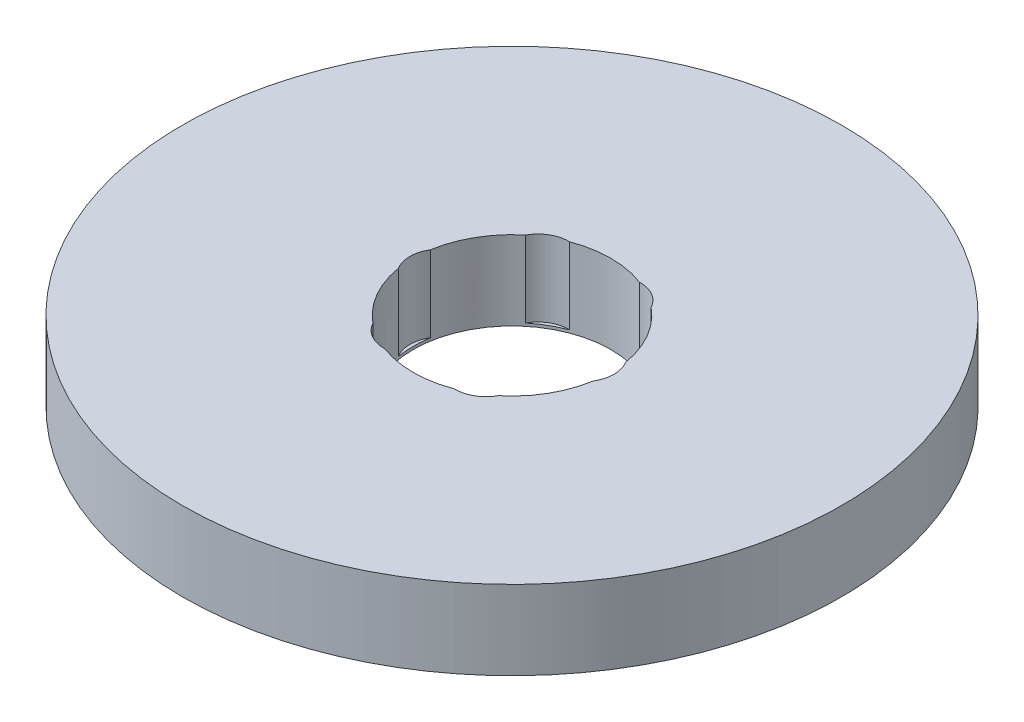
ISO-10303-21;
HEADER;
FILE_DESCRIPTION(('STEP AP214'),'2;1');
FILE_NAME('part.step','',(''),(''),'','','');
FILE_SCHEMA(('AUTOMOTIVE_DESIGN { 1 0 10303 214 1 1 1 1 }'));
ENDSEC;
DATA;
#1=APPLICATION_CONTEXT('core data for automotive mechanical design processes');
#2=APPLICATION_PROTOCOL_DEFINITION('international standard','automotive_design',2000,#1);
#3=PRODUCT_CONTEXT('',#1,'mechanical');
#4=PRODUCT('Part','Part','',(#3));
#5=PRODUCT_RELATED_PRODUCT_CATEGORY('part','',(#4));
#6=PRODUCT_DEFINITION_FORMATION('','',#4);
#7=PRODUCT_DEFINITION_CONTEXT('part definition',#1,'design');
#8=PRODUCT_DEFINITION('design','',#6,#7);
#9=PRODUCT_DEFINITION_SHAPE('','',#8);
#10=(LENGTH_UNIT() NAMED_UNIT(*) SI_UNIT(.MILLI.,.METRE.));
#11=(NAMED_UNIT(*) PLANE_ANGLE_UNIT() SI_UNIT($,.RADIAN.));
#12=(NAMED_UNIT(*) SI_UNIT($,.STERADIAN.) SOLID_ANGLE_UNIT());
#13=UNCERTAINTY_MEASURE_WITH_UNIT(LENGTH_MEASURE(1.E-05),#10,'distance_accuracy_value','');
#14=(GEOMETRIC_REPRESENTATION_CONTEXT(3) GLOBAL_UNCERTAINTY_ASSIGNED_CONTEXT((#13)) GLOBAL_UNIT_ASSIGNED_CONTEXT((#10,
#11,#12)) REPRESENTATION_CONTEXT('',''));
#15=CARTESIAN_POINT('',(0.,0.,0.));
#16=DIRECTION('',(0.,0.,1.));
#17=DIRECTION('',(1.,0.,0.));
#18=AXIS2_PLACEMENT_3D('',#15,#16,#17);
#19=CARTESIAN_POINT('',(0.,18.,0.));
#20=DIRECTION('',(0.,-1.,0.));
#21=DIRECTION('',(0.,0.,-1.));
#22=AXIS2_PLACEMENT_3D('',#19,#20,#21);
#23=CYLINDRICAL_SURFACE('',#22,75.);
#24=CARTESIAN_POINT('',(0.,18.,0.));
#25=DIRECTION('',(0.,1.,0.));
#26=DIRECTION('',(0.,0.,1.));
#27=AXIS2_PLACEMENT_3D('',#24,#25,#26);
#28=CIRCLE('',#27,75.);
#29=CARTESIAN_POINT('',(0.,18.,75.));
#30=VERTEX_POINT('',#29);
#31=EDGE_CURVE('E165',#30,#30,#28,.T.);
#32=ORIENTED_EDGE('',*,*,#31,.F.);
#33=EDGE_LOOP('',(#32));
#34=FACE_BOUND('',#33,.T.);
#35=CARTESIAN_POINT('',(0.,0.,0.));
#36=DIRECTION('',(0.,1.,0.));
#37=DIRECTION('',(0.,0.,1.));
#38=AXIS2_PLACEMENT_3D('',#35,#36,#37);
#39=CIRCLE('',#38,75.);
#40=CARTESIAN_POINT('',(0.,0.,75.));
#41=VERTEX_POINT('',#40);
#42=EDGE_CURVE('E158',#41,#41,#39,.T.);
#43=ORIENTED_EDGE('',*,*,#42,.T.);
#44=EDGE_LOOP('',(#43));
#45=FACE_BOUND('',#44,.T.);
#46=ADVANCED_FACE('F39',(#34,#45),#23,.T.);
#47=CARTESIAN_POINT('',(0.,18.,0.));
#48=DIRECTION('',(0.,1.,0.));
#49=DIRECTION('',(0.,0.,1.));
#50=AXIS2_PLACEMENT_3D('',#47,#48,#49);
#51=PLANE('',#50);
#52=CARTESIAN_POINT('',(16.188008100367,18.,0.));
#53=DIRECTION('',(0.,1.,0.));
#54=DIRECTION('',(0.,0.,-1.));
#55=AXIS2_PLACEMENT_3D('',#52,#53,#54);
#56=CIRCLE('',#55,7.03857890128766);
#57=CARTESIAN_POINT('',(22.2003846567016,18.,3.65963401100307));
#58=VERTEX_POINT('',#57);
#59=CARTESIAN_POINT('',(22.2003846567016,18.,-3.65963401100307));
#60=VERTEX_POINT('',#59);
#61=EDGE_CURVE('E218',#58,#60,#56,.T.);
#62=ORIENTED_EDGE('',*,*,#61,.F.);
#63=CARTESIAN_POINT('',(0.,18.,0.));
#64=DIRECTION('',(0.,1.,0.));
#65=DIRECTION('',(0.,0.,1.));
#66=AXIS2_PLACEMENT_3D('',#63,#64,#65);
#67=CIRCLE('',#66,22.5);
#68=CARTESIAN_POINT('',(14.2695283504331,18.,17.3962800809882));
#69=VERTEX_POINT('',#68);
#70=EDGE_CURVE('E163',#69,#58,#67,.T.);
#71=ORIENTED_EDGE('',*,*,#70,.F.);
#72=CARTESIAN_POINT('',(8.09400405018356,18.,14.0192262515861));
#73=DIRECTION('',(0.,1.,0.));
#74=DIRECTION('',(0.866025403784436,0.,-0.500000000000004));
#75=AXIS2_PLACEMENT_3D('',#72,#73,#74);
#76=CIRCLE('',#75,7.03857890128766);
#77=CARTESIAN_POINT('',(7.93085630626867,18.,21.0559140919913));
#78=VERTEX_POINT('',#77);
#79=EDGE_CURVE('E391',#78,#69,#76,.T.);
#80=ORIENTED_EDGE('',*,*,#79,.F.);
#81=CARTESIAN_POINT('',(-7.93085630626852,18.,21.0559140919914));
#82=VERTEX_POINT('',#81);
#83=EDGE_CURVE('E149',#82,#78,#67,.T.);
#84=ORIENTED_EDGE('',*,*,#83,.F.);
#85=CARTESIAN_POINT('',(-8.09400405018346,18.,14.0192262515861));
#86=DIRECTION('',(0.,1.,0.));
#87=DIRECTION('',(0.86602540378444,0.,0.499999999999998));
#88=AXIS2_PLACEMENT_3D('',#85,#86,#87);
#89=CIRCLE('',#88,7.03857890128766);
#90=CARTESIAN_POINT('',(-14.2695283504329,18.,17.3962800809883));
#91=VERTEX_POINT('',#90);
#92=EDGE_CURVE('E128',#91,#82,#89,.T.);
#93=ORIENTED_EDGE('',*,*,#92,.F.);
#94=CARTESIAN_POINT('',(-22.2003846567016,18.,3.65963401100307));
#95=VERTEX_POINT('',#94);
#96=EDGE_CURVE('E148',#95,#91,#67,.T.);
#97=ORIENTED_EDGE('',*,*,#96,.F.);
#98=CARTESIAN_POINT('',(-16.188008100367,18.,0.));
#99=DIRECTION('',(0.,1.,0.));
#100=DIRECTION('',(0.,0.,1.));
#101=AXIS2_PLACEMENT_3D('',#98,#99,#100);
#102=CIRCLE('',#101,7.03857890128766);
#103=CARTESIAN_POINT('',(-22.2003846567016,18.,-3.65963401100307));
#104=VERTEX_POINT('',#103);
#105=EDGE_CURVE('E178',#104,#95,#102,.T.);
#106=ORIENTED_EDGE('',*,*,#105,.F.);
#107=CARTESIAN_POINT('',(-14.2695283504332,18.,-17.3962800809881));
#108=VERTEX_POINT('',#107);
#109=EDGE_CURVE('E159',#108,#104,#67,.T.);
#110=ORIENTED_EDGE('',*,*,#109,.F.);
#111=CARTESIAN_POINT('',(-8.09400405018366,18.,-14.019226251586));
#112=DIRECTION('',(0.,1.,0.));
#113=DIRECTION('',(-0.866025403784433,0.,0.50000000000001));
#114=AXIS2_PLACEMENT_3D('',#111,#112,#113);
#115=CIRCLE('',#114,7.03857890128766);
#116=CARTESIAN_POINT('',(-7.93085630626882,18.,-21.0559140919913));
#117=VERTEX_POINT('',#116);
#118=EDGE_CURVE('E376',#117,#108,#115,.T.);
#119=ORIENTED_EDGE('',*,*,#118,.F.);
#120=CARTESIAN_POINT('',(7.93085630626838,18.,-21.0559140919914));
#121=VERTEX_POINT('',#120);
#122=EDGE_CURVE('E170',#121,#117,#67,.T.);
#123=ORIENTED_EDGE('',*,*,#122,.F.);
#124=CARTESIAN_POINT('',(8.09400405018337,18.,-14.0192262515862));
#125=DIRECTION('',(0.,1.,0.));
#126=DIRECTION('',(-0.866025403784443,0.,-0.499999999999992));
#127=AXIS2_PLACEMENT_3D('',#124,#125,#126);
#128=CIRCLE('',#127,7.03857890128766);
#129=CARTESIAN_POINT('',(14.2695283504328,18.,-17.3962800809884));
#130=VERTEX_POINT('',#129);
#131=EDGE_CURVE('E384',#130,#121,#128,.T.);
#132=ORIENTED_EDGE('',*,*,#131,.F.);
#133=EDGE_CURVE('E173',#60,#130,#67,.T.);
#134=ORIENTED_EDGE('',*,*,#133,.F.);
#135=EDGE_LOOP('',(#62,#71,#80,#84,#93,#97,#106,#110,#119,#123,#132,#134));
#136=FACE_BOUND('',#135,.T.);
#137=ORIENTED_EDGE('',*,*,#31,.T.);
#138=EDGE_LOOP('',(#137));
#139=FACE_BOUND('',#138,.T.);
#140=ADVANCED_FACE('F141',(#136,#139),#51,.T.);
#141=CARTESIAN_POINT('',(0.,0.,0.));
#142=DIRECTION('',(0.,1.,0.));
#143=DIRECTION('',(0.,0.,1.));
#144=AXIS2_PLACEMENT_3D('',#141,#142,#143);
#145=PLANE('',#144);
#146=CARTESIAN_POINT('',(0.,0.,0.));
#147=DIRECTION('',(0.,1.,0.));
#148=DIRECTION('',(0.,0.,1.));
#149=AXIS2_PLACEMENT_3D('',#146,#147,#148);
#150=CIRCLE('',#149,22.5);
#151=CARTESIAN_POINT('',(0.,0.,22.5));
#152=VERTEX_POINT('',#151);
#153=EDGE_CURVE('E169',#152,#152,#150,.T.);
#154=ORIENTED_EDGE('',*,*,#153,.T.);
#155=EDGE_LOOP('',(#154));
#156=FACE_BOUND('',#155,.T.);
#157=ORIENTED_EDGE('',*,*,#42,.F.);
#158=EDGE_LOOP('',(#157));
#159=FACE_BOUND('',#158,.T.);
#160=ADVANCED_FACE('F236',(#156,#159),#145,.F.);
#161=CARTESIAN_POINT('',(0.,18.,0.));
#162=DIRECTION('',(0.,-1.,0.));
#163=DIRECTION('',(0.,0.,-1.));
#164=AXIS2_PLACEMENT_3D('',#161,#162,#163);
#165=CYLINDRICAL_SURFACE('',#164,22.5);
#166=DIRECTION('',(0.,1.,0.));
#167=VECTOR('',#166,1.);
#168=CARTESIAN_POINT('',(22.2003846567016,9.32627627232997,3.65963401100308));
#169=LINE('',#168,#167);
#170=CARTESIAN_POINT('',(22.2003846567016,0.652552544659939,3.65963401100307));
#171=VERTEX_POINT('',#170);
#172=EDGE_CURVE('E11',#171,#58,#169,.T.);
#173=ORIENTED_EDGE('',*,*,#172,.F.);
#174=CARTESIAN_POINT('',(0.,0.652552544659939,0.));
#175=DIRECTION('',(0.,1.,0.));
#176=DIRECTION('',(0.,0.,1.));
#177=AXIS2_PLACEMENT_3D('',#174,#175,#176);
#178=CIRCLE('',#177,22.5);
#179=CARTESIAN_POINT('',(22.2003846567016,0.652552544659939,-3.65963401100307));
#180=VERTEX_POINT('',#179);
#181=EDGE_CURVE('E212',#171,#180,#178,.T.);
#182=ORIENTED_EDGE('',*,*,#181,.T.);
#183=DIRECTION('',(0.,1.,0.));
#184=VECTOR('',#183,1.);
#185=CARTESIAN_POINT('',(22.2003846567016,9.32627627232997,-3.65963401100308));
#186=LINE('',#185,#184);
#187=EDGE_CURVE('E46',#60,#180,#186,.F.);
#188=ORIENTED_EDGE('',*,*,#187,.F.);
#189=ORIENTED_EDGE('',*,*,#133,.T.);
#190=DIRECTION('',(0.,1.,0.));
#191=VECTOR('',#190,1.);
#192=CARTESIAN_POINT('',(14.2695283504328,9.32627627232997,-17.3962800809884));
#193=LINE('',#192,#191);
#194=CARTESIAN_POINT('',(14.2695283504328,0.652552544659939,-17.3962800809884));
#195=VERTEX_POINT('',#194);
#196=EDGE_CURVE('E202',#195,#130,#193,.T.);
#197=ORIENTED_EDGE('',*,*,#196,.F.);
#198=CARTESIAN_POINT('',(0.,0.652552544659939,0.));
#199=DIRECTION('',(0.,1.,0.));
#200=DIRECTION('',(0.,0.,1.));
#201=AXIS2_PLACEMENT_3D('',#198,#199,#200);
#202=CIRCLE('',#201,22.5);
#203=CARTESIAN_POINT('',(7.93085630626838,0.652552544659939,-21.0559140919914));
#204=VERTEX_POINT('',#203);
#205=EDGE_CURVE('E200',#195,#204,#202,.T.);
#206=ORIENTED_EDGE('',*,*,#205,.T.);
#207=DIRECTION('',(0.,1.,0.));
#208=VECTOR('',#207,1.);
#209=CARTESIAN_POINT('',(7.93085630626837,9.32627627232997,-21.0559140919914));
#210=LINE('',#209,#208);
#211=EDGE_CURVE('E205',#121,#204,#210,.F.);
#212=ORIENTED_EDGE('',*,*,#211,.F.);
#213=ORIENTED_EDGE('',*,*,#122,.T.);
#214=DIRECTION('',(0.,1.,0.));
#215=VECTOR('',#214,1.);
#216=CARTESIAN_POINT('',(-7.93085630626881,9.32627627232997,-21.0559140919913));
#217=LINE('',#216,#215);
#218=CARTESIAN_POINT('',(-7.93085630626882,0.652552544659939,-21.0559140919913));
#219=VERTEX_POINT('',#218);
#220=EDGE_CURVE('E197',#219,#117,#217,.T.);
#221=ORIENTED_EDGE('',*,*,#220,.F.);
#222=CARTESIAN_POINT('',(0.,0.652552544659939,0.));
#223=DIRECTION('',(0.,1.,0.));
#224=DIRECTION('',(0.,0.,1.));
#225=AXIS2_PLACEMENT_3D('',#222,#223,#224);
#226=CIRCLE('',#225,22.5);
#227=CARTESIAN_POINT('',(-14.2695283504332,0.652552544659939,-17.3962800809881));
#228=VERTEX_POINT('',#227);
#229=EDGE_CURVE('E136',#219,#228,#226,.T.);
#230=ORIENTED_EDGE('',*,*,#229,.T.);
#231=DIRECTION('',(0.,1.,0.));
#232=VECTOR('',#231,1.);
#233=CARTESIAN_POINT('',(-14.2695283504332,9.32627627232997,-17.3962800809881));
#234=LINE('',#233,#232);
#235=EDGE_CURVE('E193',#108,#228,#234,.F.);
#236=ORIENTED_EDGE('',*,*,#235,.F.);
#237=ORIENTED_EDGE('',*,*,#109,.T.);
#238=DIRECTION('',(0.,1.,0.));
#239=VECTOR('',#238,1.);
#240=CARTESIAN_POINT('',(-22.2003846567016,9.32627627232997,-3.65963401100308));
#241=LINE('',#240,#239);
#242=CARTESIAN_POINT('',(-22.2003846567016,0.652552544659939,-3.65963401100307));
#243=VERTEX_POINT('',#242);
#244=EDGE_CURVE('E190',#243,#104,#241,.T.);
#245=ORIENTED_EDGE('',*,*,#244,.F.);
#246=CARTESIAN_POINT('',(0.,0.652552544659939,0.));
#247=DIRECTION('',(0.,1.,0.));
#248=DIRECTION('',(0.,0.,1.));
#249=AXIS2_PLACEMENT_3D('',#246,#247,#248);
#250=CIRCLE('',#249,22.5);
#251=CARTESIAN_POINT('',(-22.2003846567016,0.652552544659939,3.65963401100307));
#252=VERTEX_POINT('',#251);
#253=EDGE_CURVE('E181',#243,#252,#250,.T.);
#254=ORIENTED_EDGE('',*,*,#253,.T.);
#255=DIRECTION('',(0.,1.,0.));
#256=VECTOR('',#255,1.);
#257=CARTESIAN_POINT('',(-22.2003846567016,9.32627627232997,3.65963401100308));
#258=LINE('',#257,#256);
#259=EDGE_CURVE('E160',#95,#252,#258,.F.);
#260=ORIENTED_EDGE('',*,*,#259,.F.);
#261=ORIENTED_EDGE('',*,*,#96,.T.);
#262=DIRECTION('',(0.,1.,0.));
#263=VECTOR('',#262,1.);
#264=CARTESIAN_POINT('',(-14.2695283504329,9.32627627232997,17.3962800809883));
#265=LINE('',#264,#263);
#266=CARTESIAN_POINT('',(-14.2695283504329,0.652552544659939,17.3962800809883));
#267=VERTEX_POINT('',#266);
#268=EDGE_CURVE('E127',#267,#91,#265,.T.);
#269=ORIENTED_EDGE('',*,*,#268,.F.);
#270=CARTESIAN_POINT('',(0.,0.652552544659939,0.));
#271=DIRECTION('',(0.,1.,0.));
#272=DIRECTION('',(0.,0.,1.));
#273=AXIS2_PLACEMENT_3D('',#270,#271,#272);
#274=CIRCLE('',#273,22.5);
#275=CARTESIAN_POINT('',(-7.93085630626852,0.652552544659939,21.0559140919914));
#276=VERTEX_POINT('',#275);
#277=EDGE_CURVE('E188',#267,#276,#274,.T.);
#278=ORIENTED_EDGE('',*,*,#277,.T.);
#279=DIRECTION('',(0.,1.,0.));
#280=VECTOR('',#279,1.);
#281=CARTESIAN_POINT('',(-7.93085630626852,9.32627627232997,21.0559140919914));
#282=LINE('',#281,#280);
#283=EDGE_CURVE('E140',#82,#276,#282,.F.);
#284=ORIENTED_EDGE('',*,*,#283,.F.);
#285=ORIENTED_EDGE('',*,*,#83,.T.);
#286=DIRECTION('',(0.,1.,0.));
#287=VECTOR('',#286,1.);
#288=CARTESIAN_POINT('',(7.93085630626867,9.32627627232997,21.0559140919913));
#289=LINE('',#288,#287);
#290=CARTESIAN_POINT('',(7.93085630626867,0.652552544659939,21.0559140919913));
#291=VERTEX_POINT('',#290);
#292=EDGE_CURVE('E215',#291,#78,#289,.T.);
#293=ORIENTED_EDGE('',*,*,#292,.F.);
#294=CARTESIAN_POINT('',(0.,0.652552544659939,0.));
#295=DIRECTION('',(0.,1.,0.));
#296=DIRECTION('',(0.,0.,1.));
#297=AXIS2_PLACEMENT_3D('',#294,#295,#296);
#298=CIRCLE('',#297,22.5);
#299=CARTESIAN_POINT('',(14.2695283504331,0.652552544659939,17.3962800809882));
#300=VERTEX_POINT('',#299);
#301=EDGE_CURVE('E210',#291,#300,#298,.T.);
#302=ORIENTED_EDGE('',*,*,#301,.T.);
#303=DIRECTION('',(0.,1.,0.));
#304=VECTOR('',#303,1.);
#305=CARTESIAN_POINT('',(14.2695283504331,9.32627627232997,17.3962800809882));
#306=LINE('',#305,#304);
#307=EDGE_CURVE('E209',#69,#300,#306,.F.);
#308=ORIENTED_EDGE('',*,*,#307,.F.);
#309=ORIENTED_EDGE('',*,*,#70,.T.);
#310=EDGE_LOOP('',(#173,#182,#188,#189,#197,#206,#212,#213,#221,#230,#236,#237,#245,#254,#260,
#261,#269,#278,#284,#285,#293,#302,#308,#309));
#311=FACE_BOUND('',#310,.T.);
#312=ORIENTED_EDGE('',*,*,#153,.F.);
#313=EDGE_LOOP('',(#312));
#314=FACE_BOUND('',#313,.T.);
#315=ADVANCED_FACE('F153',(#311,#314),#165,.F.);
#316=CARTESIAN_POINT('',(-16.188008100367,0.652552544659939,0.));
#317=DIRECTION('',(0.,1.,0.));
#318=DIRECTION('',(0.,0.,1.));
#319=AXIS2_PLACEMENT_3D('',#316,#317,#318);
#320=CYLINDRICAL_SURFACE('',#319,7.03857890128766);
#321=ORIENTED_EDGE('',*,*,#244,.T.);
#322=ORIENTED_EDGE('',*,*,#105,.T.);
#323=ORIENTED_EDGE('',*,*,#259,.T.);
#324=CARTESIAN_POINT('',(-16.188008100367,0.652552544659939,0.));
#325=DIRECTION('',(0.,1.,0.));
#326=DIRECTION('',(0.,0.,1.));
#327=AXIS2_PLACEMENT_3D('',#324,#325,#326);
#328=CIRCLE('',#327,7.03857890128766);
#329=EDGE_CURVE('E176',#243,#252,#328,.T.);
#330=ORIENTED_EDGE('',*,*,#329,.F.);
#331=EDGE_LOOP('',(#321,#322,#323,#330));
#332=FACE_BOUND('',#331,.T.);
#333=ADVANCED_FACE('F247',(#332),#320,.F.);
#334=CARTESIAN_POINT('',(-16.188008100367,0.652552544659939,0.));
#335=DIRECTION('',(0.,1.,0.));
#336=DIRECTION('',(0.,0.,1.));
#337=AXIS2_PLACEMENT_3D('',#334,#335,#336);
#338=PLANE('',#337);
#339=ORIENTED_EDGE('',*,*,#329,.T.);
#340=ORIENTED_EDGE('',*,*,#253,.F.);
#341=EDGE_LOOP('',(#339,#340));
#342=FACE_BOUND('',#341,.T.);
#343=ADVANCED_FACE('F252',(#342),#338,.T.);
#344=CARTESIAN_POINT('',(-8.09400405018346,0.652552544659939,14.0192262515861));
#345=DIRECTION('',(0.,1.,0.));
#346=DIRECTION('',(0.,0.,1.));
#347=AXIS2_PLACEMENT_3D('',#344,#345,#346);
#348=CYLINDRICAL_SURFACE('',#347,7.03857890128766);
#349=ORIENTED_EDGE('',*,*,#268,.T.);
#350=ORIENTED_EDGE('',*,*,#92,.T.);
#351=ORIENTED_EDGE('',*,*,#283,.T.);
#352=CARTESIAN_POINT('',(-8.09400405018346,0.652552544659939,14.0192262515861));
#353=DIRECTION('',(0.,1.,0.));
#354=DIRECTION('',(0.86602540378444,0.,0.499999999999998));
#355=AXIS2_PLACEMENT_3D('',#352,#353,#354);
#356=CIRCLE('',#355,7.03857890128766);
#357=EDGE_CURVE('E135',#267,#276,#356,.T.);
#358=ORIENTED_EDGE('',*,*,#357,.F.);
#359=EDGE_LOOP('',(#349,#350,#351,#358));
#360=FACE_BOUND('',#359,.T.);
#361=ADVANCED_FACE('F126',(#360),#348,.F.);
#362=CARTESIAN_POINT('',(-8.09400405018346,0.652552544659939,14.0192262515861));
#363=DIRECTION('',(0.,1.,0.));
#364=DIRECTION('',(0.86602540378444,0.,0.499999999999998));
#365=AXIS2_PLACEMENT_3D('',#362,#363,#364);
#366=PLANE('',#365);
#367=ORIENTED_EDGE('',*,*,#357,.T.);
#368=ORIENTED_EDGE('',*,*,#277,.F.);
#369=EDGE_LOOP('',(#367,#368));
#370=FACE_BOUND('',#369,.T.);
#371=ADVANCED_FACE('F259',(#370),#366,.T.);
#372=CARTESIAN_POINT('',(-8.09400405018366,0.652552544659939,-14.019226251586));
#373=DIRECTION('',(0.,1.,0.));
#374=DIRECTION('',(0.,0.,1.));
#375=AXIS2_PLACEMENT_3D('',#372,#373,#374);
#376=CYLINDRICAL_SURFACE('',#375,7.03857890128766);
#377=ORIENTED_EDGE('',*,*,#220,.T.);
#378=ORIENTED_EDGE('',*,*,#118,.T.);
#379=ORIENTED_EDGE('',*,*,#235,.T.);
#380=CARTESIAN_POINT('',(-8.09400405018366,0.652552544659939,-14.019226251586));
#381=DIRECTION('',(0.,1.,0.));
#382=DIRECTION('',(-0.866025403784433,0.,0.50000000000001));
#383=AXIS2_PLACEMENT_3D('',#380,#381,#382);
#384=CIRCLE('',#383,7.03857890128766);
#385=EDGE_CURVE('E380',#219,#228,#384,.T.);
#386=ORIENTED_EDGE('',*,*,#385,.F.);
#387=EDGE_LOOP('',(#377,#378,#379,#386));
#388=FACE_BOUND('',#387,.T.);
#389=ADVANCED_FACE('F265',(#388),#376,.F.);
#390=CARTESIAN_POINT('',(-8.09400405018366,0.652552544659939,-14.019226251586));
#391=DIRECTION('',(0.,1.,0.));
#392=DIRECTION('',(-0.866025403784433,0.,0.50000000000001));
#393=AXIS2_PLACEMENT_3D('',#390,#391,#392);
#394=PLANE('',#393);
#395=ORIENTED_EDGE('',*,*,#385,.T.);
#396=ORIENTED_EDGE('',*,*,#229,.F.);
#397=EDGE_LOOP('',(#395,#396));
#398=FACE_BOUND('',#397,.T.);
#399=ADVANCED_FACE('F308',(#398),#394,.T.);
#400=CARTESIAN_POINT('',(8.09400405018337,0.652552544659939,-14.0192262515862));
#401=DIRECTION('',(0.,1.,0.));
#402=DIRECTION('',(0.,0.,1.));
#403=AXIS2_PLACEMENT_3D('',#400,#401,#402);
#404=CYLINDRICAL_SURFACE('',#403,7.03857890128766);
#405=ORIENTED_EDGE('',*,*,#196,.T.);
#406=ORIENTED_EDGE('',*,*,#131,.T.);
#407=ORIENTED_EDGE('',*,*,#211,.T.);
#408=CARTESIAN_POINT('',(8.09400405018337,0.652552544659939,-14.0192262515862));
#409=DIRECTION('',(0.,1.,0.));
#410=DIRECTION('',(-0.866025403784443,0.,-0.499999999999992));
#411=AXIS2_PLACEMENT_3D('',#408,#409,#410);
#412=CIRCLE('',#411,7.03857890128766);
#413=EDGE_CURVE('E383',#195,#204,#412,.T.);
#414=ORIENTED_EDGE('',*,*,#413,.F.);
#415=EDGE_LOOP('',(#405,#406,#407,#414));
#416=FACE_BOUND('',#415,.T.);
#417=ADVANCED_FACE('F300',(#416),#404,.F.);
#418=CARTESIAN_POINT('',(8.09400405018337,0.652552544659939,-14.0192262515862));
#419=DIRECTION('',(0.,1.,0.));
#420=DIRECTION('',(-0.866025403784443,0.,-0.499999999999992));
#421=AXIS2_PLACEMENT_3D('',#418,#419,#420);
#422=PLANE('',#421);
#423=ORIENTED_EDGE('',*,*,#413,.T.);
#424=ORIENTED_EDGE('',*,*,#205,.F.);
#425=EDGE_LOOP('',(#423,#424));
#426=FACE_BOUND('',#425,.T.);
#427=ADVANCED_FACE('F270',(#426),#422,.T.);
#428=CARTESIAN_POINT('',(8.09400405018356,0.652552544659939,14.0192262515861));
#429=DIRECTION('',(0.,1.,0.));
#430=DIRECTION('',(0.,0.,1.));
#431=AXIS2_PLACEMENT_3D('',#428,#429,#430);
#432=CYLINDRICAL_SURFACE('',#431,7.03857890128766);
#433=ORIENTED_EDGE('',*,*,#292,.T.);
#434=ORIENTED_EDGE('',*,*,#79,.T.);
#435=ORIENTED_EDGE('',*,*,#307,.T.);
#436=CARTESIAN_POINT('',(8.09400405018356,0.652552544659939,14.0192262515861));
#437=DIRECTION('',(0.,1.,0.));
#438=DIRECTION('',(0.866025403784436,0.,-0.500000000000004));
#439=AXIS2_PLACEMENT_3D('',#436,#437,#438);
#440=CIRCLE('',#439,7.03857890128766);
#441=EDGE_CURVE('E56',#291,#300,#440,.T.);
#442=ORIENTED_EDGE('',*,*,#441,.F.);
#443=EDGE_LOOP('',(#433,#434,#435,#442));
#444=FACE_BOUND('',#443,.T.);
#445=ADVANCED_FACE('F262',(#444),#432,.F.);
#446=CARTESIAN_POINT('',(8.09400405018356,0.652552544659939,14.0192262515861));
#447=DIRECTION('',(0.,1.,0.));
#448=DIRECTION('',(0.866025403784436,0.,-0.500000000000004));
#449=AXIS2_PLACEMENT_3D('',#446,#447,#448);
#450=PLANE('',#449);
#451=ORIENTED_EDGE('',*,*,#441,.T.);
#452=ORIENTED_EDGE('',*,*,#301,.F.);
#453=EDGE_LOOP('',(#451,#452));
#454=FACE_BOUND('',#453,.T.);
#455=ADVANCED_FACE('F228',(#454),#450,.T.);
#456=CARTESIAN_POINT('',(16.188008100367,0.652552544659939,0.));
#457=DIRECTION('',(0.,1.,0.));
#458=DIRECTION('',(0.,0.,1.));
#459=AXIS2_PLACEMENT_3D('',#456,#457,#458);
#460=CYLINDRICAL_SURFACE('',#459,7.03857890128766);
#461=ORIENTED_EDGE('',*,*,#172,.T.);
#462=ORIENTED_EDGE('',*,*,#61,.T.);
#463=ORIENTED_EDGE('',*,*,#187,.T.);
#464=CARTESIAN_POINT('',(16.188008100367,0.652552544659939,0.));
#465=DIRECTION('',(0.,1.,0.));
#466=DIRECTION('',(0.,0.,-1.));
#467=AXIS2_PLACEMENT_3D('',#464,#465,#466);
#468=CIRCLE('',#467,7.03857890128766);
#469=EDGE_CURVE('E55',#171,#180,#468,.T.);
#470=ORIENTED_EDGE('',*,*,#469,.F.);
#471=EDGE_LOOP('',(#461,#462,#463,#470));
#472=FACE_BOUND('',#471,.T.);
#473=ADVANCED_FACE('F217',(#472),#460,.F.);
#474=CARTESIAN_POINT('',(16.188008100367,0.652552544659939,0.));
#475=DIRECTION('',(0.,1.,0.));
#476=DIRECTION('',(0.,0.,-1.));
#477=AXIS2_PLACEMENT_3D('',#474,#475,#476);
#478=PLANE('',#477);
#479=ORIENTED_EDGE('',*,*,#469,.T.);
#480=ORIENTED_EDGE('',*,*,#181,.F.);
#481=EDGE_LOOP('',(#479,#480));
#482=FACE_BOUND('',#481,.T.);
#483=ADVANCED_FACE('F224',(#482),#478,.T.);
#484=CLOSED_SHELL('',(#46,#140,#160,#315,#333,#343,#361,#371,#389,#399,#417,#427,#445,#455,#473,#483));
#485=MANIFOLD_SOLID_BREP('B2',#484);
#486=ADVANCED_BREP_SHAPE_REPRESENTATION('',(#18,#485),#14);
#487=SHAPE_DEFINITION_REPRESENTATION(#9,#486);
ENDSEC;
END-ISO-10303-21;
